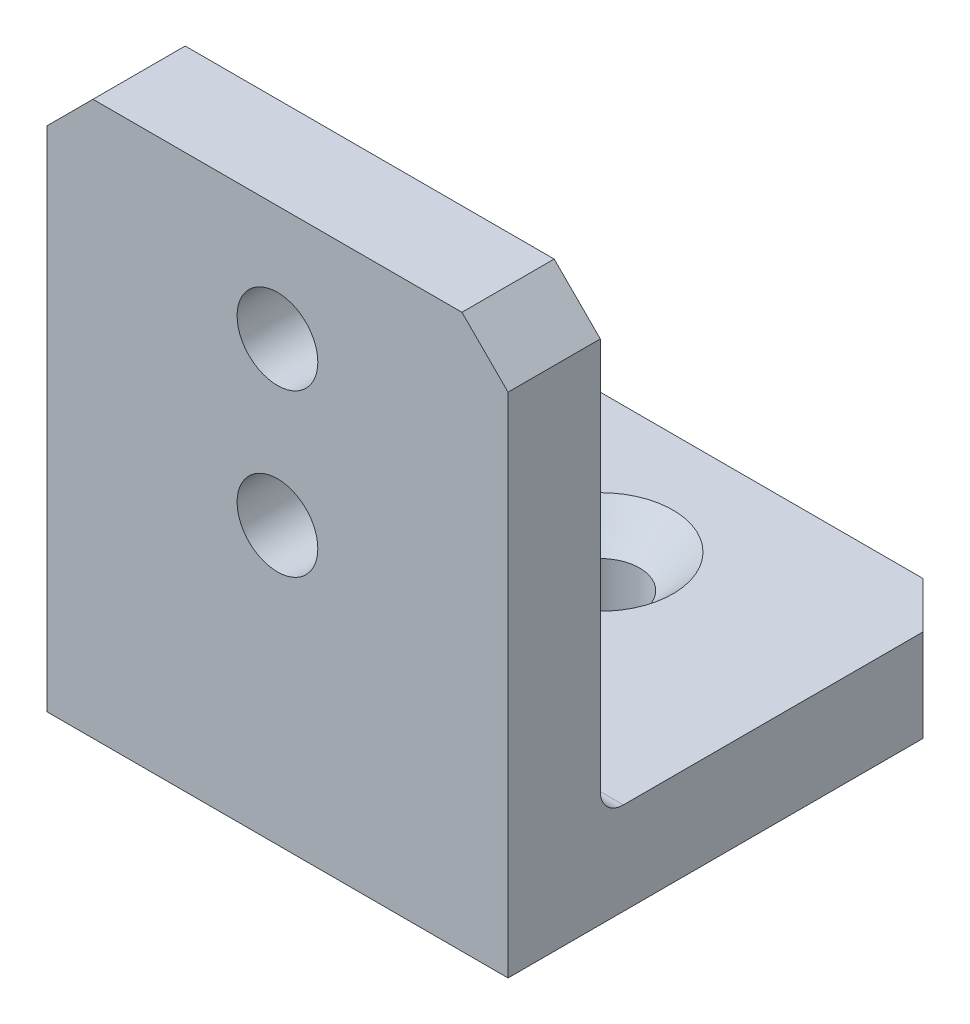
ISO-10303-21;
HEADER;
FILE_DESCRIPTION(('STEP AP214'),'2;1');
FILE_NAME('part.step','',(''),(''),'','','');
FILE_SCHEMA(('AUTOMOTIVE_DESIGN { 1 0 10303 214 1 1 1 1 }'));
ENDSEC;
DATA;
#1=APPLICATION_CONTEXT('core data for automotive mechanical design processes');
#2=APPLICATION_PROTOCOL_DEFINITION('international standard','automotive_design',2000,#1);
#3=PRODUCT_CONTEXT('',#1,'mechanical');
#4=PRODUCT('Part','Part','',(#3));
#5=PRODUCT_RELATED_PRODUCT_CATEGORY('part','',(#4));
#6=PRODUCT_DEFINITION_FORMATION('','',#4);
#7=PRODUCT_DEFINITION_CONTEXT('part definition',#1,'design');
#8=PRODUCT_DEFINITION('design','',#6,#7);
#9=PRODUCT_DEFINITION_SHAPE('','',#8);
#10=(LENGTH_UNIT() NAMED_UNIT(*) SI_UNIT(.MILLI.,.METRE.));
#11=(NAMED_UNIT(*) PLANE_ANGLE_UNIT() SI_UNIT($,.RADIAN.));
#12=(NAMED_UNIT(*) SI_UNIT($,.STERADIAN.) SOLID_ANGLE_UNIT());
#13=UNCERTAINTY_MEASURE_WITH_UNIT(LENGTH_MEASURE(1.E-05),#10,'distance_accuracy_value','');
#14=(GEOMETRIC_REPRESENTATION_CONTEXT(3) GLOBAL_UNCERTAINTY_ASSIGNED_CONTEXT((#13)) GLOBAL_UNIT_ASSIGNED_CONTEXT((#10,
#11,#12)) REPRESENTATION_CONTEXT('',''));
#15=CARTESIAN_POINT('',(0.,0.,0.));
#16=DIRECTION('',(0.,0.,1.));
#17=DIRECTION('',(1.,0.,0.));
#18=AXIS2_PLACEMENT_3D('',#15,#16,#17);
#19=CARTESIAN_POINT('',(20.,4.,20.));
#20=DIRECTION('',(0.,-1.,0.));
#21=DIRECTION('',(0.,0.,-1.));
#22=AXIS2_PLACEMENT_3D('',#19,#20,#21);
#23=PLANE('',#22);
#24=CARTESIAN_POINT('',(10.,4.,6.));
#25=DIRECTION('',(0.,1.,0.));
#26=DIRECTION('',(0.,0.,1.));
#27=AXIS2_PLACEMENT_3D('',#24,#25,#26);
#28=CIRCLE('',#27,3.15);
#29=CARTESIAN_POINT('',(10.,4.,9.15));
#30=VERTEX_POINT('',#29);
#31=EDGE_CURVE('E278',#30,#30,#28,.T.);
#32=ORIENTED_EDGE('',*,*,#31,.F.);
#33=EDGE_LOOP('',(#32));
#34=FACE_BOUND('',#33,.T.);
#35=DIRECTION('',(0.,0.,-1.));
#36=VECTOR('',#35,1.);
#37=CARTESIAN_POINT('',(20.,4.,20.));
#38=LINE('',#37,#36);
#39=CARTESIAN_POINT('',(20.,4.,15.));
#40=VERTEX_POINT('',#39);
#41=CARTESIAN_POINT('',(20.,4.,1.99999999999999));
#42=VERTEX_POINT('',#41);
#43=EDGE_CURVE('E146',#40,#42,#38,.T.);
#44=ORIENTED_EDGE('',*,*,#43,.T.);
#45=DIRECTION('',(0.707106781186548,0.,0.707106781186547));
#46=VECTOR('',#45,1.);
#47=CARTESIAN_POINT('',(20.,4.,1.99999999999999));
#48=LINE('',#47,#46);
#49=CARTESIAN_POINT('',(18.,4.,0.));
#50=VERTEX_POINT('',#49);
#51=EDGE_CURVE('E175',#42,#50,#48,.F.);
#52=ORIENTED_EDGE('',*,*,#51,.T.);
#53=DIRECTION('',(-1.,0.,0.));
#54=VECTOR('',#53,1.);
#55=CARTESIAN_POINT('',(20.,4.,0.));
#56=LINE('',#55,#54);
#57=CARTESIAN_POINT('',(2.,4.,0.));
#58=VERTEX_POINT('',#57);
#59=EDGE_CURVE('E128',#50,#58,#56,.T.);
#60=ORIENTED_EDGE('',*,*,#59,.T.);
#61=DIRECTION('',(0.707106781186548,0.,-0.707106781186547));
#62=VECTOR('',#61,1.);
#63=CARTESIAN_POINT('',(0.,4.,1.99999999999999));
#64=LINE('',#63,#62);
#65=CARTESIAN_POINT('',(0.,4.,1.99999999999999));
#66=VERTEX_POINT('',#65);
#67=EDGE_CURVE('E173',#58,#66,#64,.F.);
#68=ORIENTED_EDGE('',*,*,#67,.T.);
#69=DIRECTION('',(0.,0.,-1.));
#70=VECTOR('',#69,1.);
#71=CARTESIAN_POINT('',(0.,4.,20.));
#72=LINE('',#71,#70);
#73=CARTESIAN_POINT('',(0.,4.,15.));
#74=VERTEX_POINT('',#73);
#75=EDGE_CURVE('E199',#74,#66,#72,.T.);
#76=ORIENTED_EDGE('',*,*,#75,.F.);
#77=DIRECTION('',(-1.,0.,0.));
#78=VECTOR('',#77,1.);
#79=CARTESIAN_POINT('',(20.,4.,15.));
#80=LINE('',#79,#78);
#81=EDGE_CURVE('E144',#74,#40,#80,.F.);
#82=ORIENTED_EDGE('',*,*,#81,.T.);
#83=EDGE_LOOP('',(#44,#52,#60,#68,#76,#82));
#84=FACE_BOUND('',#83,.T.);
#85=ADVANCED_FACE('F33',(#34,#84),#23,.F.);
#86=CARTESIAN_POINT('',(0.,4.,20.));
#87=DIRECTION('',(1.,0.,0.));
#88=DIRECTION('',(0.,1.,0.));
#89=AXIS2_PLACEMENT_3D('',#86,#87,#88);
#90=PLANE('',#89);
#91=ORIENTED_EDGE('',*,*,#75,.T.);
#92=DIRECTION('',(0.,-1.,0.));
#93=VECTOR('',#92,1.);
#94=CARTESIAN_POINT('',(0.,4.,1.99999999999999));
#95=LINE('',#94,#93);
#96=CARTESIAN_POINT('',(0.,0.,1.99999999999999));
#97=VERTEX_POINT('',#96);
#98=EDGE_CURVE('E11',#66,#97,#95,.T.);
#99=ORIENTED_EDGE('',*,*,#98,.T.);
#100=DIRECTION('',(0.,0.,-1.));
#101=VECTOR('',#100,1.);
#102=CARTESIAN_POINT('',(0.,0.,20.));
#103=LINE('',#102,#101);
#104=CARTESIAN_POINT('',(0.,0.,20.));
#105=VERTEX_POINT('',#104);
#106=EDGE_CURVE('E133',#105,#97,#103,.T.);
#107=ORIENTED_EDGE('',*,*,#106,.F.);
#108=DIRECTION('',(0.,-1.,0.));
#109=VECTOR('',#108,1.);
#110=CARTESIAN_POINT('',(0.,4.,20.));
#111=LINE('',#110,#109);
#112=CARTESIAN_POINT('',(0.,22.,20.));
#113=VERTEX_POINT('',#112);
#114=EDGE_CURVE('E117',#113,#105,#111,.T.);
#115=ORIENTED_EDGE('',*,*,#114,.F.);
#116=DIRECTION('',(0.,0.,-1.));
#117=VECTOR('',#116,1.);
#118=CARTESIAN_POINT('',(0.,22.,20.));
#119=LINE('',#118,#117);
#120=CARTESIAN_POINT('',(0.,22.,16.));
#121=VERTEX_POINT('',#120);
#122=EDGE_CURVE('E160',#113,#121,#119,.T.);
#123=ORIENTED_EDGE('',*,*,#122,.T.);
#124=DIRECTION('',(0.,-1.,0.));
#125=VECTOR('',#124,1.);
#126=CARTESIAN_POINT('',(0.,24.,16.));
#127=LINE('',#126,#125);
#128=CARTESIAN_POINT('',(0.,5.,16.));
#129=VERTEX_POINT('',#128);
#130=EDGE_CURVE('E154',#121,#129,#127,.T.);
#131=ORIENTED_EDGE('',*,*,#130,.T.);
#132=CARTESIAN_POINT('',(0.,5.,15.));
#133=DIRECTION('',(1.,0.,0.));
#134=DIRECTION('',(0.,1.,0.));
#135=AXIS2_PLACEMENT_3D('',#132,#133,#134);
#136=CIRCLE('',#135,1.);
#137=EDGE_CURVE('E203',#129,#74,#136,.T.);
#138=ORIENTED_EDGE('',*,*,#137,.T.);
#139=EDGE_LOOP('',(#91,#99,#107,#115,#123,#131,#138));
#140=FACE_BOUND('',#139,.T.);
#141=ADVANCED_FACE('F140',(#140),#90,.F.);
#142=CARTESIAN_POINT('',(0.,0.,20.));
#143=DIRECTION('',(0.,1.,0.));
#144=DIRECTION('',(0.,0.,1.));
#145=AXIS2_PLACEMENT_3D('',#142,#143,#144);
#146=PLANE('',#145);
#147=CARTESIAN_POINT('',(10.,0.,6.));
#148=DIRECTION('',(0.,1.,0.));
#149=DIRECTION('',(0.,0.,1.));
#150=AXIS2_PLACEMENT_3D('',#147,#148,#149);
#151=CIRCLE('',#150,1.7);
#152=CARTESIAN_POINT('',(10.,0.,7.7));
#153=VERTEX_POINT('',#152);
#154=EDGE_CURVE('E269',#153,#153,#151,.T.);
#155=ORIENTED_EDGE('',*,*,#154,.T.);
#156=EDGE_LOOP('',(#155));
#157=FACE_BOUND('',#156,.T.);
#158=DIRECTION('',(1.,0.,0.));
#159=VECTOR('',#158,1.);
#160=CARTESIAN_POINT('',(0.,0.,0.));
#161=LINE('',#160,#159);
#162=CARTESIAN_POINT('',(2.,0.,0.));
#163=VERTEX_POINT('',#162);
#164=CARTESIAN_POINT('',(18.,0.,0.));
#165=VERTEX_POINT('',#164);
#166=EDGE_CURVE('E164',#163,#165,#161,.T.);
#167=ORIENTED_EDGE('',*,*,#166,.T.);
#168=DIRECTION('',(-0.707106781186548,0.,-0.707106781186547));
#169=VECTOR('',#168,1.);
#170=CARTESIAN_POINT('',(20.,0.,1.99999999999999));
#171=LINE('',#170,#169);
#172=CARTESIAN_POINT('',(20.,0.,1.99999999999999));
#173=VERTEX_POINT('',#172);
#174=EDGE_CURVE('E41',#165,#173,#171,.F.);
#175=ORIENTED_EDGE('',*,*,#174,.T.);
#176=DIRECTION('',(0.,0.,-1.));
#177=VECTOR('',#176,1.);
#178=CARTESIAN_POINT('',(20.,0.,20.));
#179=LINE('',#178,#177);
#180=CARTESIAN_POINT('',(20.,0.,20.));
#181=VERTEX_POINT('',#180);
#182=EDGE_CURVE('E135',#181,#173,#179,.T.);
#183=ORIENTED_EDGE('',*,*,#182,.F.);
#184=DIRECTION('',(1.,0.,0.));
#185=VECTOR('',#184,1.);
#186=CARTESIAN_POINT('',(0.,0.,20.));
#187=LINE('',#186,#185);
#188=EDGE_CURVE('E122',#105,#181,#187,.T.);
#189=ORIENTED_EDGE('',*,*,#188,.F.);
#190=ORIENTED_EDGE('',*,*,#106,.T.);
#191=DIRECTION('',(-0.707106781186548,0.,0.707106781186547));
#192=VECTOR('',#191,1.);
#193=CARTESIAN_POINT('',(0.,0.,1.99999999999999));
#194=LINE('',#193,#192);
#195=EDGE_CURVE('E48',#97,#163,#194,.F.);
#196=ORIENTED_EDGE('',*,*,#195,.T.);
#197=EDGE_LOOP('',(#167,#175,#183,#189,#190,#196));
#198=FACE_BOUND('',#197,.T.);
#199=ADVANCED_FACE('F132',(#157,#198),#146,.F.);
#200=CARTESIAN_POINT('',(20.,0.,20.));
#201=DIRECTION('',(-1.,0.,0.));
#202=DIRECTION('',(0.,0.,1.));
#203=AXIS2_PLACEMENT_3D('',#200,#201,#202);
#204=PLANE('',#203);
#205=ORIENTED_EDGE('',*,*,#182,.T.);
#206=DIRECTION('',(0.,1.,0.));
#207=VECTOR('',#206,1.);
#208=CARTESIAN_POINT('',(20.,0.,1.99999999999999));
#209=LINE('',#208,#207);
#210=EDGE_CURVE('E170',#173,#42,#209,.T.);
#211=ORIENTED_EDGE('',*,*,#210,.T.);
#212=ORIENTED_EDGE('',*,*,#43,.F.);
#213=CARTESIAN_POINT('',(20.,5.,15.));
#214=DIRECTION('',(-1.,0.,0.));
#215=DIRECTION('',(0.,0.,1.));
#216=AXIS2_PLACEMENT_3D('',#213,#214,#215);
#217=CIRCLE('',#216,1.);
#218=CARTESIAN_POINT('',(20.,5.,16.));
#219=VERTEX_POINT('',#218);
#220=EDGE_CURVE('E205',#40,#219,#217,.T.);
#221=ORIENTED_EDGE('',*,*,#220,.T.);
#222=DIRECTION('',(0.,-1.,0.));
#223=VECTOR('',#222,1.);
#224=CARTESIAN_POINT('',(20.,24.,16.));
#225=LINE('',#224,#223);
#226=CARTESIAN_POINT('',(20.,22.,16.));
#227=VERTEX_POINT('',#226);
#228=EDGE_CURVE('E157',#227,#219,#225,.T.);
#229=ORIENTED_EDGE('',*,*,#228,.F.);
#230=DIRECTION('',(0.,0.,1.));
#231=VECTOR('',#230,1.);
#232=CARTESIAN_POINT('',(20.,22.,20.));
#233=LINE('',#232,#231);
#234=CARTESIAN_POINT('',(20.,22.,20.));
#235=VERTEX_POINT('',#234);
#236=EDGE_CURVE('E168',#227,#235,#233,.T.);
#237=ORIENTED_EDGE('',*,*,#236,.T.);
#238=DIRECTION('',(0.,1.,0.));
#239=VECTOR('',#238,1.);
#240=CARTESIAN_POINT('',(20.,0.,20.));
#241=LINE('',#240,#239);
#242=EDGE_CURVE('E137',#181,#235,#241,.T.);
#243=ORIENTED_EDGE('',*,*,#242,.F.);
#244=EDGE_LOOP('',(#205,#211,#212,#221,#229,#237,#243));
#245=FACE_BOUND('',#244,.T.);
#246=ADVANCED_FACE('F184',(#245),#204,.F.);
#247=CARTESIAN_POINT('',(0.,0.,20.));
#248=DIRECTION('',(0.,0.,1.));
#249=DIRECTION('',(1.,0.,0.));
#250=AXIS2_PLACEMENT_3D('',#247,#248,#249);
#251=PLANE('',#250);
#252=CARTESIAN_POINT('',(10.,12.,20.));
#253=DIRECTION('',(0.,0.,1.));
#254=DIRECTION('',(1.,0.,0.));
#255=AXIS2_PLACEMENT_3D('',#252,#253,#254);
#256=CIRCLE('',#255,1.75);
#257=CARTESIAN_POINT('',(11.75,12.,20.));
#258=VERTEX_POINT('',#257);
#259=EDGE_CURVE('E271',#258,#258,#256,.F.);
#260=ORIENTED_EDGE('',*,*,#259,.T.);
#261=EDGE_LOOP('',(#260));
#262=FACE_BOUND('',#261,.T.);
#263=CARTESIAN_POINT('',(10.,19.,20.));
#264=DIRECTION('',(0.,0.,1.));
#265=DIRECTION('',(1.,0.,0.));
#266=AXIS2_PLACEMENT_3D('',#263,#264,#265);
#267=CIRCLE('',#266,1.75);
#268=CARTESIAN_POINT('',(11.75,19.,20.));
#269=VERTEX_POINT('',#268);
#270=EDGE_CURVE('E283',#269,#269,#267,.F.);
#271=ORIENTED_EDGE('',*,*,#270,.T.);
#272=EDGE_LOOP('',(#271));
#273=FACE_BOUND('',#272,.T.);
#274=DIRECTION('',(1.,0.,0.));
#275=VECTOR('',#274,1.);
#276=CARTESIAN_POINT('',(0.,24.,20.));
#277=LINE('',#276,#275);
#278=CARTESIAN_POINT('',(2.,24.,20.));
#279=VERTEX_POINT('',#278);
#280=CARTESIAN_POINT('',(18.,24.,20.));
#281=VERTEX_POINT('',#280);
#282=EDGE_CURVE('E216',#279,#281,#277,.T.);
#283=ORIENTED_EDGE('',*,*,#282,.F.);
#284=DIRECTION('',(0.707106781186546,0.707106781186549,0.));
#285=VECTOR('',#284,1.);
#286=CARTESIAN_POINT('',(-11.,10.9999999999999,20.));
#287=LINE('',#286,#285);
#288=EDGE_CURVE('E124',#279,#113,#287,.F.);
#289=ORIENTED_EDGE('',*,*,#288,.T.);
#290=ORIENTED_EDGE('',*,*,#114,.T.);
#291=ORIENTED_EDGE('',*,*,#188,.T.);
#292=ORIENTED_EDGE('',*,*,#242,.T.);
#293=DIRECTION('',(0.707106781186547,-0.707106781186548,0.));
#294=VECTOR('',#293,1.);
#295=CARTESIAN_POINT('',(21.,21.,20.));
#296=LINE('',#295,#294);
#297=EDGE_CURVE('E213',#235,#281,#296,.F.);
#298=ORIENTED_EDGE('',*,*,#297,.T.);
#299=EDGE_LOOP('',(#283,#289,#290,#291,#292,#298));
#300=FACE_BOUND('',#299,.T.);
#301=ADVANCED_FACE('F120',(#262,#273,#300),#251,.T.);
#302=CARTESIAN_POINT('',(0.,0.,0.));
#303=DIRECTION('',(0.,0.,1.));
#304=DIRECTION('',(1.,0.,0.));
#305=AXIS2_PLACEMENT_3D('',#302,#303,#304);
#306=PLANE('',#305);
#307=ORIENTED_EDGE('',*,*,#59,.F.);
#308=DIRECTION('',(0.,-1.,0.));
#309=VECTOR('',#308,1.);
#310=CARTESIAN_POINT('',(18.,0.,0.));
#311=LINE('',#310,#309);
#312=EDGE_CURVE('E55',#50,#165,#311,.T.);
#313=ORIENTED_EDGE('',*,*,#312,.T.);
#314=ORIENTED_EDGE('',*,*,#166,.F.);
#315=DIRECTION('',(0.,1.,0.));
#316=VECTOR('',#315,1.);
#317=CARTESIAN_POINT('',(2.,0.,0.));
#318=LINE('',#317,#316);
#319=EDGE_CURVE('E177',#163,#58,#318,.T.);
#320=ORIENTED_EDGE('',*,*,#319,.T.);
#321=EDGE_LOOP('',(#307,#313,#314,#320));
#322=FACE_BOUND('',#321,.T.);
#323=ADVANCED_FACE('F191',(#322),#306,.F.);
#324=CARTESIAN_POINT('',(0.,24.,16.));
#325=DIRECTION('',(0.,0.,1.));
#326=DIRECTION('',(1.,0.,0.));
#327=AXIS2_PLACEMENT_3D('',#324,#325,#326);
#328=PLANE('',#327);
#329=CARTESIAN_POINT('',(10.,12.,16.));
#330=DIRECTION('',(0.,0.,-1.));
#331=DIRECTION('',(-1.,0.,0.));
#332=AXIS2_PLACEMENT_3D('',#329,#330,#331);
#333=CIRCLE('',#332,1.75);
#334=CARTESIAN_POINT('',(8.25,12.,16.));
#335=VERTEX_POINT('',#334);
#336=EDGE_CURVE('E275',#335,#335,#333,.T.);
#337=ORIENTED_EDGE('',*,*,#336,.F.);
#338=EDGE_LOOP('',(#337));
#339=FACE_BOUND('',#338,.T.);
#340=CARTESIAN_POINT('',(10.,19.,16.));
#341=DIRECTION('',(0.,0.,-1.));
#342=DIRECTION('',(-1.,0.,0.));
#343=AXIS2_PLACEMENT_3D('',#340,#341,#342);
#344=CIRCLE('',#343,1.75);
#345=CARTESIAN_POINT('',(8.25,19.,16.));
#346=VERTEX_POINT('',#345);
#347=EDGE_CURVE('E225',#346,#346,#344,.T.);
#348=ORIENTED_EDGE('',*,*,#347,.F.);
#349=EDGE_LOOP('',(#348));
#350=FACE_BOUND('',#349,.T.);
#351=ORIENTED_EDGE('',*,*,#130,.F.);
#352=DIRECTION('',(-0.707106781186546,-0.707106781186549,0.));
#353=VECTOR('',#352,1.);
#354=CARTESIAN_POINT('',(2.,24.,16.));
#355=LINE('',#354,#353);
#356=CARTESIAN_POINT('',(2.,24.,16.));
#357=VERTEX_POINT('',#356);
#358=EDGE_CURVE('E166',#121,#357,#355,.F.);
#359=ORIENTED_EDGE('',*,*,#358,.T.);
#360=DIRECTION('',(-1.,0.,0.));
#361=VECTOR('',#360,1.);
#362=CARTESIAN_POINT('',(0.,24.,16.));
#363=LINE('',#362,#361);
#364=CARTESIAN_POINT('',(18.,24.,16.));
#365=VERTEX_POINT('',#364);
#366=EDGE_CURVE('E158',#365,#357,#363,.T.);
#367=ORIENTED_EDGE('',*,*,#366,.F.);
#368=DIRECTION('',(-0.707106781186547,0.707106781186548,0.));
#369=VECTOR('',#368,1.);
#370=CARTESIAN_POINT('',(18.,24.,16.));
#371=LINE('',#370,#369);
#372=EDGE_CURVE('E162',#365,#227,#371,.F.);
#373=ORIENTED_EDGE('',*,*,#372,.T.);
#374=ORIENTED_EDGE('',*,*,#228,.T.);
#375=DIRECTION('',(-1.,0.,0.));
#376=VECTOR('',#375,1.);
#377=CARTESIAN_POINT('',(0.,5.,16.));
#378=LINE('',#377,#376);
#379=EDGE_CURVE('E141',#219,#129,#378,.T.);
#380=ORIENTED_EDGE('',*,*,#379,.T.);
#381=EDGE_LOOP('',(#351,#359,#367,#373,#374,#380));
#382=FACE_BOUND('',#381,.T.);
#383=ADVANCED_FACE('F231',(#339,#350,#382),#328,.F.);
#384=CARTESIAN_POINT('',(0.,24.,0.));
#385=DIRECTION('',(0.,-1.,0.));
#386=DIRECTION('',(0.,0.,-1.));
#387=AXIS2_PLACEMENT_3D('',#384,#385,#386);
#388=PLANE('',#387);
#389=ORIENTED_EDGE('',*,*,#366,.T.);
#390=DIRECTION('',(0.,0.,1.));
#391=VECTOR('',#390,1.);
#392=CARTESIAN_POINT('',(2.,24.,0.));
#393=LINE('',#392,#391);
#394=EDGE_CURVE('E211',#357,#279,#393,.T.);
#395=ORIENTED_EDGE('',*,*,#394,.T.);
#396=ORIENTED_EDGE('',*,*,#282,.T.);
#397=DIRECTION('',(0.,0.,-1.));
#398=VECTOR('',#397,1.);
#399=CARTESIAN_POINT('',(18.,24.,0.));
#400=LINE('',#399,#398);
#401=EDGE_CURVE('E208',#281,#365,#400,.T.);
#402=ORIENTED_EDGE('',*,*,#401,.T.);
#403=EDGE_LOOP('',(#389,#395,#396,#402));
#404=FACE_BOUND('',#403,.T.);
#405=ADVANCED_FACE('F222',(#404),#388,.F.);
#406=CARTESIAN_POINT('',(10.,19.,20.001));
#407=DIRECTION('',(0.,0.,-1.));
#408=DIRECTION('',(-1.,0.,0.));
#409=AXIS2_PLACEMENT_3D('',#406,#407,#408);
#410=CYLINDRICAL_SURFACE('',#409,1.75);
#411=ORIENTED_EDGE('',*,*,#270,.F.);
#412=EDGE_LOOP('',(#411));
#413=FACE_BOUND('',#412,.T.);
#414=ORIENTED_EDGE('',*,*,#347,.T.);
#415=EDGE_LOOP('',(#414));
#416=FACE_BOUND('',#415,.T.);
#417=ADVANCED_FACE('F292',(#413,#416),#410,.F.);
#418=CARTESIAN_POINT('',(10.,12.,20.001));
#419=DIRECTION('',(0.,0.,-1.));
#420=DIRECTION('',(-1.,0.,0.));
#421=AXIS2_PLACEMENT_3D('',#418,#419,#420);
#422=CYLINDRICAL_SURFACE('',#421,1.75);
#423=ORIENTED_EDGE('',*,*,#259,.F.);
#424=EDGE_LOOP('',(#423));
#425=FACE_BOUND('',#424,.T.);
#426=ORIENTED_EDGE('',*,*,#336,.T.);
#427=EDGE_LOOP('',(#426));
#428=FACE_BOUND('',#427,.T.);
#429=ADVANCED_FACE('F248',(#425,#428),#422,.F.);
#430=CARTESIAN_POINT('',(0.,5.,15.));
#431=DIRECTION('',(1.,0.,0.));
#432=DIRECTION('',(0.,0.,-1.));
#433=AXIS2_PLACEMENT_3D('',#430,#431,#432);
#434=CYLINDRICAL_SURFACE('',#433,1.);
#435=ORIENTED_EDGE('',*,*,#220,.F.);
#436=ORIENTED_EDGE('',*,*,#81,.F.);
#437=ORIENTED_EDGE('',*,*,#137,.F.);
#438=ORIENTED_EDGE('',*,*,#379,.F.);
#439=EDGE_LOOP('',(#435,#436,#437,#438));
#440=FACE_BOUND('',#439,.T.);
#441=ADVANCED_FACE('F237',(#440),#434,.F.);
#442=CARTESIAN_POINT('',(2.,24.,0.));
#443=DIRECTION('',(0.707106781186549,-0.707106781186546,0.));
#444=DIRECTION('',(0.,0.,1.));
#445=AXIS2_PLACEMENT_3D('',#442,#443,#444);
#446=PLANE('',#445);
#447=ORIENTED_EDGE('',*,*,#358,.F.);
#448=ORIENTED_EDGE('',*,*,#122,.F.);
#449=ORIENTED_EDGE('',*,*,#288,.F.);
#450=ORIENTED_EDGE('',*,*,#394,.F.);
#451=EDGE_LOOP('',(#447,#448,#449,#450));
#452=FACE_BOUND('',#451,.T.);
#453=ADVANCED_FACE('F240',(#452),#446,.F.);
#454=CARTESIAN_POINT('',(18.,24.,0.));
#455=DIRECTION('',(-0.707106781186548,-0.707106781186547,0.));
#456=DIRECTION('',(0.,0.,-1.));
#457=AXIS2_PLACEMENT_3D('',#454,#455,#456);
#458=PLANE('',#457);
#459=ORIENTED_EDGE('',*,*,#297,.F.);
#460=ORIENTED_EDGE('',*,*,#236,.F.);
#461=ORIENTED_EDGE('',*,*,#372,.F.);
#462=ORIENTED_EDGE('',*,*,#401,.F.);
#463=EDGE_LOOP('',(#459,#460,#461,#462));
#464=FACE_BOUND('',#463,.T.);
#465=ADVANCED_FACE('F227',(#464),#458,.F.);
#466=CARTESIAN_POINT('',(20.,0.,1.99999999999999));
#467=DIRECTION('',(-0.707106781186547,0.,0.707106781186548));
#468=DIRECTION('',(0.,1.,0.));
#469=AXIS2_PLACEMENT_3D('',#466,#467,#468);
#470=PLANE('',#469);
#471=ORIENTED_EDGE('',*,*,#174,.F.);
#472=ORIENTED_EDGE('',*,*,#312,.F.);
#473=ORIENTED_EDGE('',*,*,#51,.F.);
#474=ORIENTED_EDGE('',*,*,#210,.F.);
#475=EDGE_LOOP('',(#471,#472,#473,#474));
#476=FACE_BOUND('',#475,.T.);
#477=ADVANCED_FACE('F187',(#476),#470,.F.);
#478=CARTESIAN_POINT('',(0.,4.,1.99999999999999));
#479=DIRECTION('',(0.707106781186547,0.,0.707106781186548));
#480=DIRECTION('',(0.,-1.,0.));
#481=AXIS2_PLACEMENT_3D('',#478,#479,#480);
#482=PLANE('',#481);
#483=ORIENTED_EDGE('',*,*,#67,.F.);
#484=ORIENTED_EDGE('',*,*,#319,.F.);
#485=ORIENTED_EDGE('',*,*,#195,.F.);
#486=ORIENTED_EDGE('',*,*,#98,.F.);
#487=EDGE_LOOP('',(#483,#484,#485,#486));
#488=FACE_BOUND('',#487,.T.);
#489=ADVANCED_FACE('F35',(#488),#482,.F.);
#490=CARTESIAN_POINT('',(10.,4.,6.));
#491=DIRECTION('',(0.,1.,0.));
#492=DIRECTION('',(0.,0.,1.));
#493=AXIS2_PLACEMENT_3D('',#490,#491,#492);
#494=CYLINDRICAL_SURFACE('',#493,1.7);
#495=ORIENTED_EDGE('',*,*,#154,.F.);
#496=EDGE_LOOP('',(#495));
#497=FACE_BOUND('',#496,.T.);
#498=CARTESIAN_POINT('',(10.,2.55,6.));
#499=DIRECTION('',(0.,1.,0.));
#500=DIRECTION('',(0.,0.,1.));
#501=AXIS2_PLACEMENT_3D('',#498,#499,#500);
#502=CIRCLE('',#501,1.7);
#503=CARTESIAN_POINT('',(10.,2.55,7.7));
#504=VERTEX_POINT('',#503);
#505=EDGE_CURVE('E272',#504,#504,#502,.T.);
#506=ORIENTED_EDGE('',*,*,#505,.T.);
#507=EDGE_LOOP('',(#506));
#508=FACE_BOUND('',#507,.T.);
#509=ADVANCED_FACE('F319',(#497,#508),#494,.F.);
#510=CARTESIAN_POINT('',(10.,4.,6.));
#511=DIRECTION('',(0.,1.,0.));
#512=DIRECTION('',(0.,0.,1.));
#513=AXIS2_PLACEMENT_3D('',#510,#511,#512);
#514=CONICAL_SURFACE('',#513,3.15,0.785398163397448);
#515=ORIENTED_EDGE('',*,*,#505,.F.);
#516=EDGE_LOOP('',(#515));
#517=FACE_BOUND('',#516,.T.);
#518=ORIENTED_EDGE('',*,*,#31,.T.);
#519=EDGE_LOOP('',(#518));
#520=FACE_BOUND('',#519,.T.);
#521=ADVANCED_FACE('F322',(#517,#520),#514,.F.);
#522=CLOSED_SHELL('',(#85,#141,#199,#246,#301,#323,#383,#405,#417,#429,#441,#453,#465,#477,#489,
#509,#521));
#523=MANIFOLD_SOLID_BREP('B2',#522);
#524=ADVANCED_BREP_SHAPE_REPRESENTATION('',(#18,#523),#14);
#525=SHAPE_DEFINITION_REPRESENTATION(#9,#524);
ENDSEC;
END-ISO-10303-21;
